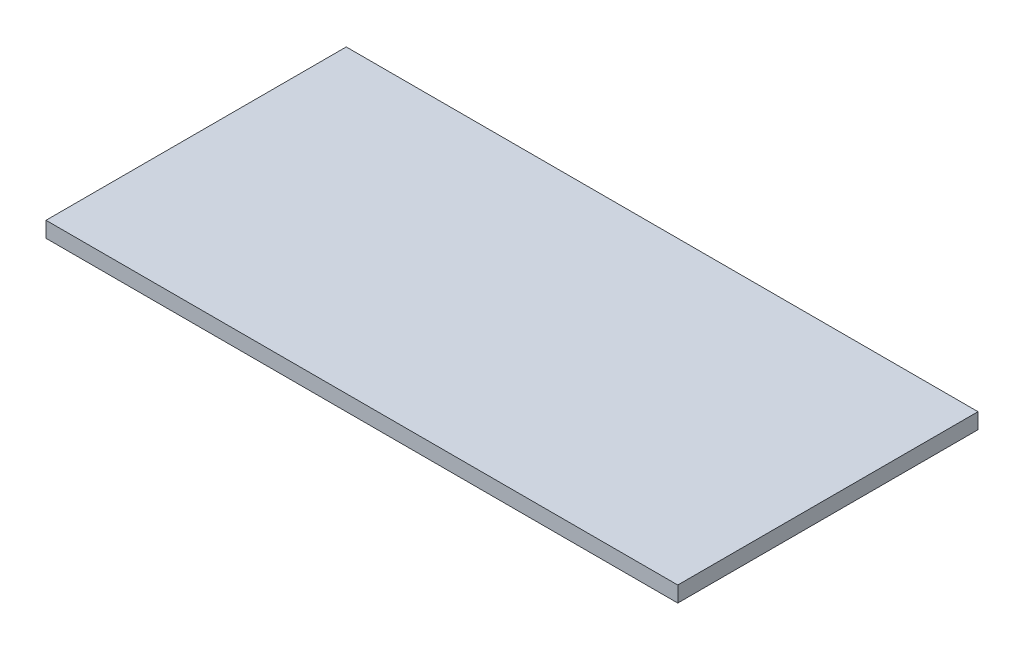
ISO-10303-21;
HEADER;
FILE_DESCRIPTION(('STEP AP214'),'2;1');
FILE_NAME('part.step','',(''),(''),'','','');
FILE_SCHEMA(('AUTOMOTIVE_DESIGN { 1 0 10303 214 1 1 1 1 }'));
ENDSEC;
DATA;
#1=APPLICATION_CONTEXT('core data for automotive mechanical design processes');
#2=APPLICATION_PROTOCOL_DEFINITION('international standard','automotive_design',2000,#1);
#3=PRODUCT_CONTEXT('',#1,'mechanical');
#4=PRODUCT('Part','Part','',(#3));
#5=PRODUCT_RELATED_PRODUCT_CATEGORY('part','',(#4));
#6=PRODUCT_DEFINITION_FORMATION('','',#4);
#7=PRODUCT_DEFINITION_CONTEXT('part definition',#1,'design');
#8=PRODUCT_DEFINITION('design','',#6,#7);
#9=PRODUCT_DEFINITION_SHAPE('','',#8);
#10=(LENGTH_UNIT() NAMED_UNIT(*) SI_UNIT(.MILLI.,.METRE.));
#11=(NAMED_UNIT(*) PLANE_ANGLE_UNIT() SI_UNIT($,.RADIAN.));
#12=(NAMED_UNIT(*) SI_UNIT($,.STERADIAN.) SOLID_ANGLE_UNIT());
#13=UNCERTAINTY_MEASURE_WITH_UNIT(LENGTH_MEASURE(1.E-05),#10,'distance_accuracy_value','');
#14=(GEOMETRIC_REPRESENTATION_CONTEXT(3) GLOBAL_UNCERTAINTY_ASSIGNED_CONTEXT((#13)) GLOBAL_UNIT_ASSIGNED_CONTEXT((#10,
#11,#12)) REPRESENTATION_CONTEXT('',''));
#15=CARTESIAN_POINT('',(0.,0.,0.));
#16=DIRECTION('',(0.,0.,1.));
#17=DIRECTION('',(1.,0.,0.));
#18=AXIS2_PLACEMENT_3D('',#15,#16,#17);
#19=CARTESIAN_POINT('',(0.,2.9972,0.));
#20=DIRECTION('',(1.,0.,0.));
#21=DIRECTION('',(0.,0.,-1.));
#22=AXIS2_PLACEMENT_3D('',#19,#20,#21);
#23=PLANE('',#22);
#24=DIRECTION('',(0.,0.,1.));
#25=VECTOR('',#24,1.);
#26=CARTESIAN_POINT('',(0.,0.,0.));
#27=LINE('',#26,#25);
#28=CARTESIAN_POINT('',(0.,0.,0.));
#29=VERTEX_POINT('',#28);
#30=CARTESIAN_POINT('',(0.,0.,57.5056));
#31=VERTEX_POINT('',#30);
#32=EDGE_CURVE('E96',#29,#31,#27,.T.);
#33=ORIENTED_EDGE('',*,*,#32,.T.);
#34=DIRECTION('',(0.,-1.,0.));
#35=VECTOR('',#34,1.);
#36=CARTESIAN_POINT('',(0.,2.9972,57.5056));
#37=LINE('',#36,#35);
#38=CARTESIAN_POINT('',(0.,2.9972,57.5056));
#39=VERTEX_POINT('',#38);
#40=EDGE_CURVE('E11',#39,#31,#37,.T.);
#41=ORIENTED_EDGE('',*,*,#40,.F.);
#42=DIRECTION('',(0.,0.,1.));
#43=VECTOR('',#42,1.);
#44=CARTESIAN_POINT('',(0.,2.9972,0.));
#45=LINE('',#44,#43);
#46=CARTESIAN_POINT('',(0.,2.9972,0.));
#47=VERTEX_POINT('',#46);
#48=EDGE_CURVE('E84',#47,#39,#45,.T.);
#49=ORIENTED_EDGE('',*,*,#48,.F.);
#50=DIRECTION('',(0.,-1.,0.));
#51=VECTOR('',#50,1.);
#52=CARTESIAN_POINT('',(0.,2.9972,0.));
#53=LINE('',#52,#51);
#54=EDGE_CURVE('E92',#47,#29,#53,.T.);
#55=ORIENTED_EDGE('',*,*,#54,.T.);
#56=EDGE_LOOP('',(#33,#41,#49,#55));
#57=FACE_BOUND('',#56,.T.);
#58=ADVANCED_FACE('F33',(#57),#23,.F.);
#59=CARTESIAN_POINT('',(0.,2.9972,57.5056));
#60=DIRECTION('',(0.,0.,-1.));
#61=DIRECTION('',(-1.,0.,0.));
#62=AXIS2_PLACEMENT_3D('',#59,#60,#61);
#63=PLANE('',#62);
#64=DIRECTION('',(1.,0.,0.));
#65=VECTOR('',#64,1.);
#66=CARTESIAN_POINT('',(0.,0.,57.5056));
#67=LINE('',#66,#65);
#68=CARTESIAN_POINT('',(121.0056,0.,57.5056));
#69=VERTEX_POINT('',#68);
#70=EDGE_CURVE('E88',#31,#69,#67,.T.);
#71=ORIENTED_EDGE('',*,*,#70,.T.);
#72=DIRECTION('',(0.,-1.,0.));
#73=VECTOR('',#72,1.);
#74=CARTESIAN_POINT('',(121.0056,2.9972,57.5056));
#75=LINE('',#74,#73);
#76=CARTESIAN_POINT('',(121.0056,2.9972,57.5056));
#77=VERTEX_POINT('',#76);
#78=EDGE_CURVE('E41',#77,#69,#75,.T.);
#79=ORIENTED_EDGE('',*,*,#78,.F.);
#80=DIRECTION('',(1.,0.,0.));
#81=VECTOR('',#80,1.);
#82=CARTESIAN_POINT('',(0.,2.9972,57.5056));
#83=LINE('',#82,#81);
#84=EDGE_CURVE('E79',#39,#77,#83,.T.);
#85=ORIENTED_EDGE('',*,*,#84,.F.);
#86=ORIENTED_EDGE('',*,*,#40,.T.);
#87=EDGE_LOOP('',(#71,#79,#85,#86));
#88=FACE_BOUND('',#87,.T.);
#89=ADVANCED_FACE('F87',(#88),#63,.F.);
#90=CARTESIAN_POINT('',(121.0056,2.9972,0.));
#91=DIRECTION('',(-1.,0.,0.));
#92=DIRECTION('',(0.,0.,1.));
#93=AXIS2_PLACEMENT_3D('',#90,#91,#92);
#94=PLANE('',#93);
#95=DIRECTION('',(0.,0.,-1.));
#96=VECTOR('',#95,1.);
#97=CARTESIAN_POINT('',(121.0056,0.,0.));
#98=LINE('',#97,#96);
#99=CARTESIAN_POINT('',(121.0056,0.,0.));
#100=VERTEX_POINT('',#99);
#101=EDGE_CURVE('E66',#69,#100,#98,.T.);
#102=ORIENTED_EDGE('',*,*,#101,.T.);
#103=DIRECTION('',(0.,-1.,0.));
#104=VECTOR('',#103,1.);
#105=CARTESIAN_POINT('',(121.0056,2.9972,0.));
#106=LINE('',#105,#104);
#107=CARTESIAN_POINT('',(121.0056,2.9972,0.));
#108=VERTEX_POINT('',#107);
#109=EDGE_CURVE('E89',#108,#100,#106,.T.);
#110=ORIENTED_EDGE('',*,*,#109,.F.);
#111=DIRECTION('',(0.,0.,-1.));
#112=VECTOR('',#111,1.);
#113=CARTESIAN_POINT('',(121.0056,2.9972,0.));
#114=LINE('',#113,#112);
#115=EDGE_CURVE('E82',#77,#108,#114,.T.);
#116=ORIENTED_EDGE('',*,*,#115,.F.);
#117=ORIENTED_EDGE('',*,*,#78,.T.);
#118=EDGE_LOOP('',(#102,#110,#116,#117));
#119=FACE_BOUND('',#118,.T.);
#120=ADVANCED_FACE('F90',(#119),#94,.F.);
#121=CARTESIAN_POINT('',(0.,2.9972,0.));
#122=DIRECTION('',(0.,0.,1.));
#123=DIRECTION('',(1.,0.,0.));
#124=AXIS2_PLACEMENT_3D('',#121,#122,#123);
#125=PLANE('',#124);
#126=DIRECTION('',(-1.,0.,0.));
#127=VECTOR('',#126,1.);
#128=CARTESIAN_POINT('',(0.,0.,0.));
#129=LINE('',#128,#127);
#130=EDGE_CURVE('E72',#100,#29,#129,.T.);
#131=ORIENTED_EDGE('',*,*,#130,.T.);
#132=ORIENTED_EDGE('',*,*,#54,.F.);
#133=DIRECTION('',(-1.,0.,0.));
#134=VECTOR('',#133,1.);
#135=CARTESIAN_POINT('',(0.,2.9972,0.));
#136=LINE('',#135,#134);
#137=EDGE_CURVE('E49',#108,#47,#136,.T.);
#138=ORIENTED_EDGE('',*,*,#137,.F.);
#139=ORIENTED_EDGE('',*,*,#109,.T.);
#140=EDGE_LOOP('',(#131,#132,#138,#139));
#141=FACE_BOUND('',#140,.T.);
#142=ADVANCED_FACE('F103',(#141),#125,.F.);
#143=CARTESIAN_POINT('',(0.,2.9972,0.));
#144=DIRECTION('',(0.,1.,0.));
#145=DIRECTION('',(0.,0.,1.));
#146=AXIS2_PLACEMENT_3D('',#143,#144,#145);
#147=PLANE('',#146);
#148=ORIENTED_EDGE('',*,*,#48,.T.);
#149=ORIENTED_EDGE('',*,*,#84,.T.);
#150=ORIENTED_EDGE('',*,*,#115,.T.);
#151=ORIENTED_EDGE('',*,*,#137,.T.);
#152=EDGE_LOOP('',(#148,#149,#150,#151));
#153=FACE_BOUND('',#152,.T.);
#154=ADVANCED_FACE('F80',(#153),#147,.T.);
#155=CARTESIAN_POINT('',(0.,0.,0.));
#156=DIRECTION('',(0.,1.,0.));
#157=DIRECTION('',(0.,0.,1.));
#158=AXIS2_PLACEMENT_3D('',#155,#156,#157);
#159=PLANE('',#158);
#160=ORIENTED_EDGE('',*,*,#32,.F.);
#161=ORIENTED_EDGE('',*,*,#130,.F.);
#162=ORIENTED_EDGE('',*,*,#101,.F.);
#163=ORIENTED_EDGE('',*,*,#70,.F.);
#164=EDGE_LOOP('',(#160,#161,#162,#163));
#165=FACE_BOUND('',#164,.T.);
#166=ADVANCED_FACE('F106',(#165),#159,.F.);
#167=CLOSED_SHELL('',(#58,#89,#120,#142,#154,#166));
#168=MANIFOLD_SOLID_BREP('B2',#167);
#169=ADVANCED_BREP_SHAPE_REPRESENTATION('',(#18,#168),#14);
#170=SHAPE_DEFINITION_REPRESENTATION(#9,#169);
ENDSEC;
END-ISO-10303-21;
